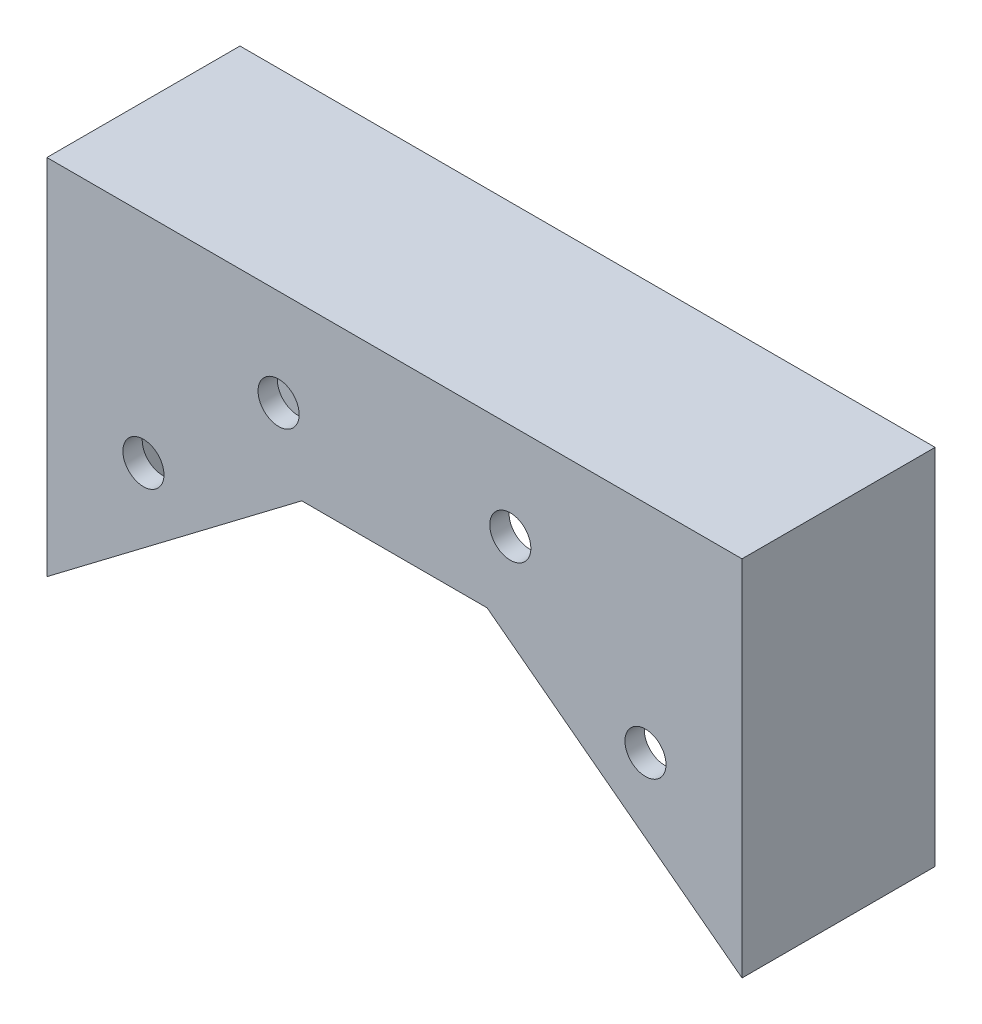
ISO-10303-21;
HEADER;
FILE_DESCRIPTION(('STEP AP214'),'2;1');
FILE_NAME('part.step','',(''),(''),'','','');
FILE_SCHEMA(('AUTOMOTIVE_DESIGN { 1 0 10303 214 1 1 1 1 }'));
ENDSEC;
DATA;
#1=APPLICATION_CONTEXT('core data for automotive mechanical design processes');
#2=APPLICATION_PROTOCOL_DEFINITION('international standard','automotive_design',2000,#1);
#3=PRODUCT_CONTEXT('',#1,'mechanical');
#4=PRODUCT('Part','Part','',(#3));
#5=PRODUCT_RELATED_PRODUCT_CATEGORY('part','',(#4));
#6=PRODUCT_DEFINITION_FORMATION('','',#4);
#7=PRODUCT_DEFINITION_CONTEXT('part definition',#1,'design');
#8=PRODUCT_DEFINITION('design','',#6,#7);
#9=PRODUCT_DEFINITION_SHAPE('','',#8);
#10=(LENGTH_UNIT() NAMED_UNIT(*) SI_UNIT(.MILLI.,.METRE.));
#11=(NAMED_UNIT(*) PLANE_ANGLE_UNIT() SI_UNIT($,.RADIAN.));
#12=(NAMED_UNIT(*) SI_UNIT($,.STERADIAN.) SOLID_ANGLE_UNIT());
#13=UNCERTAINTY_MEASURE_WITH_UNIT(LENGTH_MEASURE(1.E-05),#10,'distance_accuracy_value','');
#14=(GEOMETRIC_REPRESENTATION_CONTEXT(3) GLOBAL_UNCERTAINTY_ASSIGNED_CONTEXT((#13)) GLOBAL_UNIT_ASSIGNED_CONTEXT((#10,
#11,#12)) REPRESENTATION_CONTEXT('',''));
#15=CARTESIAN_POINT('',(0.,0.,0.));
#16=DIRECTION('',(0.,0.,1.));
#17=DIRECTION('',(1.,0.,0.));
#18=AXIS2_PLACEMENT_3D('',#15,#16,#17);
#19=CARTESIAN_POINT('',(-15.24,0.,15.875));
#20=DIRECTION('',(-0.603857687995462,0.79709214815401,0.));
#21=DIRECTION('',(-0.79709214815401,-0.603857687995462,0.));
#22=AXIS2_PLACEMENT_3D('',#19,#20,#21);
#23=PLANE('',#22);
#24=DIRECTION('',(0.79709214815401,0.603857687995462,0.));
#25=VECTOR('',#24,1.);
#26=CARTESIAN_POINT('',(-15.24,0.,-12.7));
#27=LINE('',#26,#25);
#28=CARTESIAN_POINT('',(-53.975,-29.344696969697,-12.7));
#29=VERTEX_POINT('',#28);
#30=CARTESIAN_POINT('',(-15.24,0.,-12.7));
#31=VERTEX_POINT('',#30);
#32=EDGE_CURVE('E176',#29,#31,#27,.T.);
#33=ORIENTED_EDGE('',*,*,#32,.F.);
#34=DIRECTION('',(0.,0.,-1.));
#35=VECTOR('',#34,1.);
#36=CARTESIAN_POINT('',(-53.975,-29.344696969697,15.875));
#37=LINE('',#36,#35);
#38=CARTESIAN_POINT('',(-53.975,-29.344696969697,12.7));
#39=VERTEX_POINT('',#38);
#40=EDGE_CURVE('E194',#39,#29,#37,.T.);
#41=ORIENTED_EDGE('',*,*,#40,.F.);
#42=DIRECTION('',(0.79709214815401,0.603857687995462,0.));
#43=VECTOR('',#42,1.);
#44=CARTESIAN_POINT('',(-15.24,0.,12.7));
#45=LINE('',#44,#43);
#46=CARTESIAN_POINT('',(-15.24,0.,12.7));
#47=VERTEX_POINT('',#46);
#48=EDGE_CURVE('E200',#39,#47,#45,.T.);
#49=ORIENTED_EDGE('',*,*,#48,.T.);
#50=DIRECTION('',(0.,0.,-1.));
#51=VECTOR('',#50,1.);
#52=CARTESIAN_POINT('',(-15.24,0.,15.875));
#53=LINE('',#52,#51);
#54=CARTESIAN_POINT('',(-15.24,0.,15.875));
#55=VERTEX_POINT('',#54);
#56=EDGE_CURVE('E11',#55,#47,#53,.T.);
#57=ORIENTED_EDGE('',*,*,#56,.F.);
#58=DIRECTION('',(0.79709214815401,0.603857687995462,0.));
#59=VECTOR('',#58,1.);
#60=CARTESIAN_POINT('',(-15.24,0.,15.875));
#61=LINE('',#60,#59);
#62=CARTESIAN_POINT('',(-57.15,-31.75,15.875));
#63=VERTEX_POINT('',#62);
#64=EDGE_CURVE('E143',#63,#55,#61,.T.);
#65=ORIENTED_EDGE('',*,*,#64,.F.);
#66=DIRECTION('',(0.,0.,-1.));
#67=VECTOR('',#66,1.);
#68=CARTESIAN_POINT('',(-57.15,-31.75,15.875));
#69=LINE('',#68,#67);
#70=CARTESIAN_POINT('',(-57.15,-31.75,-15.875));
#71=VERTEX_POINT('',#70);
#72=EDGE_CURVE('E126',#63,#71,#69,.T.);
#73=ORIENTED_EDGE('',*,*,#72,.T.);
#74=DIRECTION('',(0.79709214815401,0.603857687995462,0.));
#75=VECTOR('',#74,1.);
#76=CARTESIAN_POINT('',(-15.24,0.,-15.875));
#77=LINE('',#76,#75);
#78=CARTESIAN_POINT('',(-15.24,0.,-15.875));
#79=VERTEX_POINT('',#78);
#80=EDGE_CURVE('E130',#71,#79,#77,.T.);
#81=ORIENTED_EDGE('',*,*,#80,.T.);
#82=EDGE_CURVE('E40',#31,#79,#53,.T.);
#83=ORIENTED_EDGE('',*,*,#82,.F.);
#84=EDGE_LOOP('',(#33,#41,#49,#57,#65,#73,#81,#83));
#85=FACE_BOUND('',#84,.T.);
#86=ADVANCED_FACE('F32',(#85),#23,.F.);
#87=CARTESIAN_POINT('',(-15.24,0.,15.875));
#88=DIRECTION('',(0.,1.,0.));
#89=DIRECTION('',(0.,0.,1.));
#90=AXIS2_PLACEMENT_3D('',#87,#88,#89);
#91=PLANE('',#90);
#92=DIRECTION('',(1.,0.,0.));
#93=VECTOR('',#92,1.);
#94=CARTESIAN_POINT('',(-15.24,0.,-12.7));
#95=LINE('',#94,#93);
#96=CARTESIAN_POINT('',(15.24,0.,-12.7));
#97=VERTEX_POINT('',#96);
#98=EDGE_CURVE('E216',#31,#97,#95,.T.);
#99=ORIENTED_EDGE('',*,*,#98,.F.);
#100=ORIENTED_EDGE('',*,*,#82,.T.);
#101=DIRECTION('',(1.,0.,0.));
#102=VECTOR('',#101,1.);
#103=CARTESIAN_POINT('',(-15.24,0.,-15.875));
#104=LINE('',#103,#102);
#105=CARTESIAN_POINT('',(15.24,0.,-15.875));
#106=VERTEX_POINT('',#105);
#107=EDGE_CURVE('E133',#79,#106,#104,.T.);
#108=ORIENTED_EDGE('',*,*,#107,.T.);
#109=DIRECTION('',(0.,0.,-1.));
#110=VECTOR('',#109,1.);
#111=CARTESIAN_POINT('',(15.24,0.,15.875));
#112=LINE('',#111,#110);
#113=EDGE_CURVE('E147',#97,#106,#112,.T.);
#114=ORIENTED_EDGE('',*,*,#113,.F.);
#115=EDGE_LOOP('',(#99,#100,#108,#114));
#116=FACE_BOUND('',#115,.T.);
#117=ADVANCED_FACE('F274',(#116),#91,.F.);
#118=CARTESIAN_POINT('',(15.24,0.,15.875));
#119=DIRECTION('',(0.603857687995462,0.79709214815401,0.));
#120=DIRECTION('',(-0.79709214815401,0.603857687995462,0.));
#121=AXIS2_PLACEMENT_3D('',#118,#119,#120);
#122=PLANE('',#121);
#123=DIRECTION('',(0.79709214815401,-0.603857687995462,0.));
#124=VECTOR('',#123,1.);
#125=CARTESIAN_POINT('',(15.24,0.,-12.7));
#126=LINE('',#125,#124);
#127=CARTESIAN_POINT('',(53.975,-29.344696969697,-12.7));
#128=VERTEX_POINT('',#127);
#129=EDGE_CURVE('E181',#97,#128,#126,.T.);
#130=ORIENTED_EDGE('',*,*,#129,.F.);
#131=ORIENTED_EDGE('',*,*,#113,.T.);
#132=DIRECTION('',(0.79709214815401,-0.603857687995462,0.));
#133=VECTOR('',#132,1.);
#134=CARTESIAN_POINT('',(15.24,0.,-15.875));
#135=LINE('',#134,#133);
#136=CARTESIAN_POINT('',(57.15,-31.75,-15.875));
#137=VERTEX_POINT('',#136);
#138=EDGE_CURVE('E137',#106,#137,#135,.T.);
#139=ORIENTED_EDGE('',*,*,#138,.T.);
#140=DIRECTION('',(0.,0.,-1.));
#141=VECTOR('',#140,1.);
#142=CARTESIAN_POINT('',(57.15,-31.75,15.875));
#143=LINE('',#142,#141);
#144=CARTESIAN_POINT('',(57.15,-31.75,15.875));
#145=VERTEX_POINT('',#144);
#146=EDGE_CURVE('E121',#145,#137,#143,.T.);
#147=ORIENTED_EDGE('',*,*,#146,.F.);
#148=DIRECTION('',(0.79709214815401,-0.603857687995462,0.));
#149=VECTOR('',#148,1.);
#150=CARTESIAN_POINT('',(15.24,0.,15.875));
#151=LINE('',#150,#149);
#152=CARTESIAN_POINT('',(15.24,0.,15.875));
#153=VERTEX_POINT('',#152);
#154=EDGE_CURVE('E109',#153,#145,#151,.T.);
#155=ORIENTED_EDGE('',*,*,#154,.F.);
#156=CARTESIAN_POINT('',(15.24,0.,12.7));
#157=VERTEX_POINT('',#156);
#158=EDGE_CURVE('E148',#153,#157,#112,.T.);
#159=ORIENTED_EDGE('',*,*,#158,.T.);
#160=DIRECTION('',(0.79709214815401,-0.603857687995462,0.));
#161=VECTOR('',#160,1.);
#162=CARTESIAN_POINT('',(15.24,0.,12.7));
#163=LINE('',#162,#161);
#164=CARTESIAN_POINT('',(53.975,-29.344696969697,12.7));
#165=VERTEX_POINT('',#164);
#166=EDGE_CURVE('E188',#157,#165,#163,.T.);
#167=ORIENTED_EDGE('',*,*,#166,.T.);
#168=DIRECTION('',(0.,0.,-1.));
#169=VECTOR('',#168,1.);
#170=CARTESIAN_POINT('',(53.975,-29.344696969697,15.875));
#171=LINE('',#170,#169);
#172=EDGE_CURVE('E134',#165,#128,#171,.T.);
#173=ORIENTED_EDGE('',*,*,#172,.T.);
#174=EDGE_LOOP('',(#130,#131,#139,#147,#155,#159,#167,#173));
#175=FACE_BOUND('',#174,.T.);
#176=ADVANCED_FACE('F229',(#175),#122,.F.);
#177=ORIENTED_EDGE('',*,*,#56,.T.);
#178=DIRECTION('',(1.,0.,0.));
#179=VECTOR('',#178,1.);
#180=CARTESIAN_POINT('',(-15.24,0.,12.7));
#181=LINE('',#180,#179);
#182=EDGE_CURVE('E207',#47,#157,#181,.T.);
#183=ORIENTED_EDGE('',*,*,#182,.T.);
#184=ORIENTED_EDGE('',*,*,#158,.F.);
#185=DIRECTION('',(1.,0.,0.));
#186=VECTOR('',#185,1.);
#187=CARTESIAN_POINT('',(-15.24,0.,15.875));
#188=LINE('',#187,#186);
#189=EDGE_CURVE('E92',#55,#153,#188,.T.);
#190=ORIENTED_EDGE('',*,*,#189,.F.);
#191=EDGE_LOOP('',(#177,#183,#184,#190));
#192=FACE_BOUND('',#191,.T.);
#193=ADVANCED_FACE('F224',(#192),#91,.F.);
#194=CARTESIAN_POINT('',(57.15,-31.75,15.875));
#195=DIRECTION('',(-1.,0.,0.));
#196=DIRECTION('',(0.,-1.,0.));
#197=AXIS2_PLACEMENT_3D('',#194,#195,#196);
#198=PLANE('',#197);
#199=DIRECTION('',(0.,1.,0.));
#200=VECTOR('',#199,1.);
#201=CARTESIAN_POINT('',(57.15,-31.75,-15.875));
#202=LINE('',#201,#200);
#203=CARTESIAN_POINT('',(57.15,27.94,-15.875));
#204=VERTEX_POINT('',#203);
#205=EDGE_CURVE('E118',#137,#204,#202,.T.);
#206=ORIENTED_EDGE('',*,*,#205,.T.);
#207=DIRECTION('',(0.,0.,-1.));
#208=VECTOR('',#207,1.);
#209=CARTESIAN_POINT('',(57.15,27.94,15.875));
#210=LINE('',#209,#208);
#211=CARTESIAN_POINT('',(57.15,27.94,15.875));
#212=VERTEX_POINT('',#211);
#213=EDGE_CURVE('E115',#212,#204,#210,.T.);
#214=ORIENTED_EDGE('',*,*,#213,.F.);
#215=DIRECTION('',(0.,1.,0.));
#216=VECTOR('',#215,1.);
#217=CARTESIAN_POINT('',(57.15,-31.75,15.875));
#218=LINE('',#217,#216);
#219=EDGE_CURVE('E102',#145,#212,#218,.T.);
#220=ORIENTED_EDGE('',*,*,#219,.F.);
#221=ORIENTED_EDGE('',*,*,#146,.T.);
#222=EDGE_LOOP('',(#206,#214,#220,#221));
#223=FACE_BOUND('',#222,.T.);
#224=ADVANCED_FACE('F116',(#223),#198,.F.);
#225=CARTESIAN_POINT('',(57.15,27.94,15.875));
#226=DIRECTION('',(0.,-1.,0.));
#227=DIRECTION('',(0.,0.,-1.));
#228=AXIS2_PLACEMENT_3D('',#225,#226,#227);
#229=PLANE('',#228);
#230=DIRECTION('',(-1.,0.,0.));
#231=VECTOR('',#230,1.);
#232=CARTESIAN_POINT('',(57.15,27.94,-15.875));
#233=LINE('',#232,#231);
#234=CARTESIAN_POINT('',(-57.15,27.94,-15.875));
#235=VERTEX_POINT('',#234);
#236=EDGE_CURVE('E140',#204,#235,#233,.T.);
#237=ORIENTED_EDGE('',*,*,#236,.T.);
#238=DIRECTION('',(0.,0.,-1.));
#239=VECTOR('',#238,1.);
#240=CARTESIAN_POINT('',(-57.15,27.94,15.875));
#241=LINE('',#240,#239);
#242=CARTESIAN_POINT('',(-57.15,27.94,15.875));
#243=VERTEX_POINT('',#242);
#244=EDGE_CURVE('E122',#243,#235,#241,.T.);
#245=ORIENTED_EDGE('',*,*,#244,.F.);
#246=DIRECTION('',(-1.,0.,0.));
#247=VECTOR('',#246,1.);
#248=CARTESIAN_POINT('',(57.15,27.94,15.875));
#249=LINE('',#248,#247);
#250=EDGE_CURVE('E106',#212,#243,#249,.T.);
#251=ORIENTED_EDGE('',*,*,#250,.F.);
#252=ORIENTED_EDGE('',*,*,#213,.T.);
#253=EDGE_LOOP('',(#237,#245,#251,#252));
#254=FACE_BOUND('',#253,.T.);
#255=ADVANCED_FACE('F124',(#254),#229,.F.);
#256=CARTESIAN_POINT('',(-57.15,-31.75,15.875));
#257=DIRECTION('',(1.,0.,0.));
#258=DIRECTION('',(0.,1.,0.));
#259=AXIS2_PLACEMENT_3D('',#256,#257,#258);
#260=PLANE('',#259);
#261=DIRECTION('',(0.,-1.,0.));
#262=VECTOR('',#261,1.);
#263=CARTESIAN_POINT('',(-57.15,-31.75,-15.875));
#264=LINE('',#263,#262);
#265=EDGE_CURVE('E84',#235,#71,#264,.T.);
#266=ORIENTED_EDGE('',*,*,#265,.T.);
#267=ORIENTED_EDGE('',*,*,#72,.F.);
#268=DIRECTION('',(0.,-1.,0.));
#269=VECTOR('',#268,1.);
#270=CARTESIAN_POINT('',(-57.15,-31.75,15.875));
#271=LINE('',#270,#269);
#272=EDGE_CURVE('E57',#243,#63,#271,.T.);
#273=ORIENTED_EDGE('',*,*,#272,.F.);
#274=ORIENTED_EDGE('',*,*,#244,.T.);
#275=EDGE_LOOP('',(#266,#267,#273,#274));
#276=FACE_BOUND('',#275,.T.);
#277=ADVANCED_FACE('F235',(#276),#260,.F.);
#278=CARTESIAN_POINT('',(0.,0.,15.875));
#279=DIRECTION('',(0.,0.,1.));
#280=DIRECTION('',(1.,0.,0.));
#281=AXIS2_PLACEMENT_3D('',#278,#279,#280);
#282=PLANE('',#281);
#283=CARTESIAN_POINT('',(-41.275,-7.62,15.875));
#284=DIRECTION('',(0.,0.,-1.));
#285=DIRECTION('',(-1.,0.,0.));
#286=AXIS2_PLACEMENT_3D('',#283,#284,#285);
#287=CIRCLE('',#286,3.3782);
#288=CARTESIAN_POINT('',(-44.6532,-7.62,15.875));
#289=VERTEX_POINT('',#288);
#290=EDGE_CURVE('E155',#289,#289,#287,.T.);
#291=ORIENTED_EDGE('',*,*,#290,.T.);
#292=EDGE_LOOP('',(#291));
#293=FACE_BOUND('',#292,.T.);
#294=CARTESIAN_POINT('',(-19.05,12.065,15.875));
#295=DIRECTION('',(0.,0.,-1.));
#296=DIRECTION('',(-1.,0.,0.));
#297=AXIS2_PLACEMENT_3D('',#294,#295,#296);
#298=CIRCLE('',#297,3.3782);
#299=CARTESIAN_POINT('',(-22.4282,12.065,15.875));
#300=VERTEX_POINT('',#299);
#301=EDGE_CURVE('E424',#300,#300,#298,.T.);
#302=ORIENTED_EDGE('',*,*,#301,.T.);
#303=EDGE_LOOP('',(#302));
#304=FACE_BOUND('',#303,.T.);
#305=CARTESIAN_POINT('',(19.05,12.065,15.875));
#306=DIRECTION('',(0.,0.,-1.));
#307=DIRECTION('',(1.,0.,0.));
#308=AXIS2_PLACEMENT_3D('',#305,#306,#307);
#309=CIRCLE('',#308,3.3782);
#310=CARTESIAN_POINT('',(22.4282,12.065,15.875));
#311=VERTEX_POINT('',#310);
#312=EDGE_CURVE('E432',#311,#311,#309,.T.);
#313=ORIENTED_EDGE('',*,*,#312,.T.);
#314=EDGE_LOOP('',(#313));
#315=FACE_BOUND('',#314,.T.);
#316=CARTESIAN_POINT('',(41.275,-7.62,15.875));
#317=DIRECTION('',(0.,0.,-1.));
#318=DIRECTION('',(1.,0.,0.));
#319=AXIS2_PLACEMENT_3D('',#316,#317,#318);
#320=CIRCLE('',#319,3.3782);
#321=CARTESIAN_POINT('',(44.6532,-7.62,15.875));
#322=VERTEX_POINT('',#321);
#323=EDGE_CURVE('E438',#322,#322,#320,.T.);
#324=ORIENTED_EDGE('',*,*,#323,.T.);
#325=EDGE_LOOP('',(#324));
#326=FACE_BOUND('',#325,.T.);
#327=ORIENTED_EDGE('',*,*,#64,.T.);
#328=ORIENTED_EDGE('',*,*,#189,.T.);
#329=ORIENTED_EDGE('',*,*,#154,.T.);
#330=ORIENTED_EDGE('',*,*,#219,.T.);
#331=ORIENTED_EDGE('',*,*,#250,.T.);
#332=ORIENTED_EDGE('',*,*,#272,.T.);
#333=EDGE_LOOP('',(#327,#328,#329,#330,#331,#332));
#334=FACE_BOUND('',#333,.T.);
#335=ADVANCED_FACE('F104',(#293,#304,#315,#326,#334),#282,.T.);
#336=CARTESIAN_POINT('',(0.,0.,-15.875));
#337=DIRECTION('',(0.,0.,1.));
#338=DIRECTION('',(1.,0.,0.));
#339=AXIS2_PLACEMENT_3D('',#336,#337,#338);
#340=PLANE('',#339);
#341=CARTESIAN_POINT('',(-41.275,-7.62,-15.875));
#342=DIRECTION('',(0.,0.,-1.));
#343=DIRECTION('',(-1.,0.,0.));
#344=AXIS2_PLACEMENT_3D('',#341,#342,#343);
#345=CIRCLE('',#344,3.3782);
#346=CARTESIAN_POINT('',(-44.6532,-7.62,-15.875));
#347=VERTEX_POINT('',#346);
#348=EDGE_CURVE('E421',#347,#347,#345,.T.);
#349=ORIENTED_EDGE('',*,*,#348,.F.);
#350=EDGE_LOOP('',(#349));
#351=FACE_BOUND('',#350,.T.);
#352=CARTESIAN_POINT('',(-19.05,12.065,-15.875));
#353=DIRECTION('',(0.,0.,-1.));
#354=DIRECTION('',(-1.,0.,0.));
#355=AXIS2_PLACEMENT_3D('',#352,#353,#354);
#356=CIRCLE('',#355,3.3782);
#357=CARTESIAN_POINT('',(-22.4282,12.065,-15.875));
#358=VERTEX_POINT('',#357);
#359=EDGE_CURVE('E429',#358,#358,#356,.T.);
#360=ORIENTED_EDGE('',*,*,#359,.F.);
#361=EDGE_LOOP('',(#360));
#362=FACE_BOUND('',#361,.T.);
#363=CARTESIAN_POINT('',(19.05,12.065,-15.875));
#364=DIRECTION('',(0.,0.,-1.));
#365=DIRECTION('',(1.,0.,0.));
#366=AXIS2_PLACEMENT_3D('',#363,#364,#365);
#367=CIRCLE('',#366,3.3782);
#368=CARTESIAN_POINT('',(22.4282,12.065,-15.875));
#369=VERTEX_POINT('',#368);
#370=EDGE_CURVE('E435',#369,#369,#367,.T.);
#371=ORIENTED_EDGE('',*,*,#370,.F.);
#372=EDGE_LOOP('',(#371));
#373=FACE_BOUND('',#372,.T.);
#374=CARTESIAN_POINT('',(41.275,-7.62,-15.875));
#375=DIRECTION('',(0.,0.,-1.));
#376=DIRECTION('',(1.,0.,0.));
#377=AXIS2_PLACEMENT_3D('',#374,#375,#376);
#378=CIRCLE('',#377,3.3782);
#379=CARTESIAN_POINT('',(44.6532,-7.62,-15.875));
#380=VERTEX_POINT('',#379);
#381=EDGE_CURVE('E440',#380,#380,#378,.T.);
#382=ORIENTED_EDGE('',*,*,#381,.F.);
#383=EDGE_LOOP('',(#382));
#384=FACE_BOUND('',#383,.T.);
#385=ORIENTED_EDGE('',*,*,#80,.F.);
#386=ORIENTED_EDGE('',*,*,#265,.F.);
#387=ORIENTED_EDGE('',*,*,#236,.F.);
#388=ORIENTED_EDGE('',*,*,#205,.F.);
#389=ORIENTED_EDGE('',*,*,#138,.F.);
#390=ORIENTED_EDGE('',*,*,#107,.F.);
#391=EDGE_LOOP('',(#385,#386,#387,#388,#389,#390));
#392=FACE_BOUND('',#391,.T.);
#393=ADVANCED_FACE('F233',(#351,#362,#373,#384,#392),#340,.F.);
#394=CARTESIAN_POINT('',(53.975,-31.75,15.875));
#395=DIRECTION('',(-1.,0.,0.));
#396=DIRECTION('',(0.,-1.,0.));
#397=AXIS2_PLACEMENT_3D('',#394,#395,#396);
#398=PLANE('',#397);
#399=DIRECTION('',(0.,1.,0.));
#400=VECTOR('',#399,1.);
#401=CARTESIAN_POINT('',(53.975,-31.75,-12.7));
#402=LINE('',#401,#400);
#403=CARTESIAN_POINT('',(53.975,24.765,-12.7));
#404=VERTEX_POINT('',#403);
#405=EDGE_CURVE('E177',#128,#404,#402,.T.);
#406=ORIENTED_EDGE('',*,*,#405,.F.);
#407=ORIENTED_EDGE('',*,*,#172,.F.);
#408=DIRECTION('',(0.,1.,0.));
#409=VECTOR('',#408,1.);
#410=CARTESIAN_POINT('',(53.975,-31.75,12.7));
#411=LINE('',#410,#409);
#412=CARTESIAN_POINT('',(53.975,24.765,12.7));
#413=VERTEX_POINT('',#412);
#414=EDGE_CURVE('E48',#165,#413,#411,.T.);
#415=ORIENTED_EDGE('',*,*,#414,.T.);
#416=DIRECTION('',(0.,0.,-1.));
#417=VECTOR('',#416,1.);
#418=CARTESIAN_POINT('',(53.975,24.765,15.875));
#419=LINE('',#418,#417);
#420=EDGE_CURVE('E182',#413,#404,#419,.T.);
#421=ORIENTED_EDGE('',*,*,#420,.T.);
#422=EDGE_LOOP('',(#406,#407,#415,#421));
#423=FACE_BOUND('',#422,.T.);
#424=ADVANCED_FACE('F276',(#423),#398,.T.);
#425=CARTESIAN_POINT('',(57.15,24.765,15.875));
#426=DIRECTION('',(0.,-1.,0.));
#427=DIRECTION('',(0.,0.,-1.));
#428=AXIS2_PLACEMENT_3D('',#425,#426,#427);
#429=PLANE('',#428);
#430=DIRECTION('',(-1.,0.,0.));
#431=VECTOR('',#430,1.);
#432=CARTESIAN_POINT('',(57.15,24.765,-12.7));
#433=LINE('',#432,#431);
#434=CARTESIAN_POINT('',(-53.975,24.765,-12.7));
#435=VERTEX_POINT('',#434);
#436=EDGE_CURVE('E180',#404,#435,#433,.T.);
#437=ORIENTED_EDGE('',*,*,#436,.F.);
#438=ORIENTED_EDGE('',*,*,#420,.F.);
#439=DIRECTION('',(-1.,0.,0.));
#440=VECTOR('',#439,1.);
#441=CARTESIAN_POINT('',(57.15,24.765,12.7));
#442=LINE('',#441,#440);
#443=CARTESIAN_POINT('',(-53.975,24.765,12.7));
#444=VERTEX_POINT('',#443);
#445=EDGE_CURVE('E187',#413,#444,#442,.T.);
#446=ORIENTED_EDGE('',*,*,#445,.T.);
#447=DIRECTION('',(0.,0.,-1.));
#448=VECTOR('',#447,1.);
#449=CARTESIAN_POINT('',(-53.975,24.765,15.875));
#450=LINE('',#449,#448);
#451=EDGE_CURVE('E185',#444,#435,#450,.T.);
#452=ORIENTED_EDGE('',*,*,#451,.T.);
#453=EDGE_LOOP('',(#437,#438,#446,#452));
#454=FACE_BOUND('',#453,.T.);
#455=ADVANCED_FACE('F264',(#454),#429,.T.);
#456=CARTESIAN_POINT('',(-53.975,-31.75,15.875));
#457=DIRECTION('',(1.,0.,0.));
#458=DIRECTION('',(0.,1.,0.));
#459=AXIS2_PLACEMENT_3D('',#456,#457,#458);
#460=PLANE('',#459);
#461=DIRECTION('',(0.,-1.,0.));
#462=VECTOR('',#461,1.);
#463=CARTESIAN_POINT('',(-53.975,-31.75,-12.7));
#464=LINE('',#463,#462);
#465=EDGE_CURVE('E191',#435,#29,#464,.T.);
#466=ORIENTED_EDGE('',*,*,#465,.F.);
#467=ORIENTED_EDGE('',*,*,#451,.F.);
#468=DIRECTION('',(0.,-1.,0.));
#469=VECTOR('',#468,1.);
#470=CARTESIAN_POINT('',(-53.975,-31.75,12.7));
#471=LINE('',#470,#469);
#472=EDGE_CURVE('E197',#444,#39,#471,.T.);
#473=ORIENTED_EDGE('',*,*,#472,.T.);
#474=ORIENTED_EDGE('',*,*,#40,.T.);
#475=EDGE_LOOP('',(#466,#467,#473,#474));
#476=FACE_BOUND('',#475,.T.);
#477=ADVANCED_FACE('F268',(#476),#460,.T.);
#478=CARTESIAN_POINT('',(0.,0.,12.7));
#479=DIRECTION('',(0.,0.,1.));
#480=DIRECTION('',(1.,0.,0.));
#481=AXIS2_PLACEMENT_3D('',#478,#479,#480);
#482=PLANE('',#481);
#483=CARTESIAN_POINT('',(-41.275,-7.62,12.7));
#484=DIRECTION('',(0.,0.,1.));
#485=DIRECTION('',(1.,0.,0.));
#486=AXIS2_PLACEMENT_3D('',#483,#484,#485);
#487=CIRCLE('',#486,3.3782);
#488=CARTESIAN_POINT('',(-37.8968,-7.62,12.7));
#489=VERTEX_POINT('',#488);
#490=EDGE_CURVE('E173',#489,#489,#487,.T.);
#491=ORIENTED_EDGE('',*,*,#490,.T.);
#492=EDGE_LOOP('',(#491));
#493=FACE_BOUND('',#492,.T.);
#494=CARTESIAN_POINT('',(-19.05,12.065,12.7));
#495=DIRECTION('',(0.,0.,1.));
#496=DIRECTION('',(1.,0.,0.));
#497=AXIS2_PLACEMENT_3D('',#494,#495,#496);
#498=CIRCLE('',#497,3.3782);
#499=CARTESIAN_POINT('',(-15.6718,12.065,12.7));
#500=VERTEX_POINT('',#499);
#501=EDGE_CURVE('E161',#500,#500,#498,.T.);
#502=ORIENTED_EDGE('',*,*,#501,.T.);
#503=EDGE_LOOP('',(#502));
#504=FACE_BOUND('',#503,.T.);
#505=CARTESIAN_POINT('',(19.05,12.065,12.7));
#506=DIRECTION('',(0.,0.,1.));
#507=DIRECTION('',(1.,0.,0.));
#508=AXIS2_PLACEMENT_3D('',#505,#506,#507);
#509=CIRCLE('',#508,3.3782);
#510=CARTESIAN_POINT('',(22.4282,12.065,12.7));
#511=VERTEX_POINT('',#510);
#512=EDGE_CURVE('E158',#511,#511,#509,.T.);
#513=ORIENTED_EDGE('',*,*,#512,.T.);
#514=EDGE_LOOP('',(#513));
#515=FACE_BOUND('',#514,.T.);
#516=CARTESIAN_POINT('',(41.275,-7.62,12.7));
#517=DIRECTION('',(0.,0.,1.));
#518=DIRECTION('',(1.,0.,0.));
#519=AXIS2_PLACEMENT_3D('',#516,#517,#518);
#520=CIRCLE('',#519,3.3782);
#521=CARTESIAN_POINT('',(44.6532,-7.62,12.7));
#522=VERTEX_POINT('',#521);
#523=EDGE_CURVE('E154',#522,#522,#520,.T.);
#524=ORIENTED_EDGE('',*,*,#523,.T.);
#525=EDGE_LOOP('',(#524));
#526=FACE_BOUND('',#525,.T.);
#527=ORIENTED_EDGE('',*,*,#48,.F.);
#528=ORIENTED_EDGE('',*,*,#472,.F.);
#529=ORIENTED_EDGE('',*,*,#445,.F.);
#530=ORIENTED_EDGE('',*,*,#414,.F.);
#531=ORIENTED_EDGE('',*,*,#166,.F.);
#532=ORIENTED_EDGE('',*,*,#182,.F.);
#533=EDGE_LOOP('',(#527,#528,#529,#530,#531,#532));
#534=FACE_BOUND('',#533,.T.);
#535=ADVANCED_FACE('F269',(#493,#504,#515,#526,#534),#482,.F.);
#536=CARTESIAN_POINT('',(0.,0.,-12.7));
#537=DIRECTION('',(0.,0.,1.));
#538=DIRECTION('',(1.,0.,0.));
#539=AXIS2_PLACEMENT_3D('',#536,#537,#538);
#540=PLANE('',#539);
#541=CARTESIAN_POINT('',(-41.275,-7.62,-12.7));
#542=DIRECTION('',(0.,0.,1.));
#543=DIRECTION('',(1.,0.,0.));
#544=AXIS2_PLACEMENT_3D('',#541,#542,#543);
#545=CIRCLE('',#544,3.3782);
#546=CARTESIAN_POINT('',(-37.8968,-7.62,-12.7));
#547=VERTEX_POINT('',#546);
#548=EDGE_CURVE('E35',#547,#547,#545,.T.);
#549=ORIENTED_EDGE('',*,*,#548,.F.);
#550=EDGE_LOOP('',(#549));
#551=FACE_BOUND('',#550,.T.);
#552=CARTESIAN_POINT('',(-19.05,12.065,-12.7));
#553=DIRECTION('',(0.,0.,1.));
#554=DIRECTION('',(1.,0.,0.));
#555=AXIS2_PLACEMENT_3D('',#552,#553,#554);
#556=CIRCLE('',#555,3.3782);
#557=CARTESIAN_POINT('',(-15.6718,12.065,-12.7));
#558=VERTEX_POINT('',#557);
#559=EDGE_CURVE('E159',#558,#558,#556,.T.);
#560=ORIENTED_EDGE('',*,*,#559,.F.);
#561=EDGE_LOOP('',(#560));
#562=FACE_BOUND('',#561,.T.);
#563=CARTESIAN_POINT('',(19.05,12.065,-12.7));
#564=DIRECTION('',(0.,0.,1.));
#565=DIRECTION('',(1.,0.,0.));
#566=AXIS2_PLACEMENT_3D('',#563,#564,#565);
#567=CIRCLE('',#566,3.3782);
#568=CARTESIAN_POINT('',(22.4282,12.065,-12.7));
#569=VERTEX_POINT('',#568);
#570=EDGE_CURVE('E156',#569,#569,#567,.T.);
#571=ORIENTED_EDGE('',*,*,#570,.F.);
#572=EDGE_LOOP('',(#571));
#573=FACE_BOUND('',#572,.T.);
#574=CARTESIAN_POINT('',(41.275,-7.62,-12.7));
#575=DIRECTION('',(0.,0.,1.));
#576=DIRECTION('',(1.,0.,0.));
#577=AXIS2_PLACEMENT_3D('',#574,#575,#576);
#578=CIRCLE('',#577,3.3782);
#579=CARTESIAN_POINT('',(44.6532,-7.62,-12.7));
#580=VERTEX_POINT('',#579);
#581=EDGE_CURVE('E151',#580,#580,#578,.T.);
#582=ORIENTED_EDGE('',*,*,#581,.F.);
#583=EDGE_LOOP('',(#582));
#584=FACE_BOUND('',#583,.T.);
#585=ORIENTED_EDGE('',*,*,#32,.T.);
#586=ORIENTED_EDGE('',*,*,#98,.T.);
#587=ORIENTED_EDGE('',*,*,#129,.T.);
#588=ORIENTED_EDGE('',*,*,#405,.T.);
#589=ORIENTED_EDGE('',*,*,#436,.T.);
#590=ORIENTED_EDGE('',*,*,#465,.T.);
#591=EDGE_LOOP('',(#585,#586,#587,#588,#589,#590));
#592=FACE_BOUND('',#591,.T.);
#593=ADVANCED_FACE('F271',(#551,#562,#573,#584,#592),#540,.T.);
#594=CARTESIAN_POINT('',(41.275,-7.62,15.875));
#595=DIRECTION('',(0.,0.,-1.));
#596=DIRECTION('',(-1.,0.,0.));
#597=AXIS2_PLACEMENT_3D('',#594,#595,#596);
#598=CYLINDRICAL_SURFACE('',#597,3.3782);
#599=ORIENTED_EDGE('',*,*,#581,.T.);
#600=EDGE_LOOP('',(#599));
#601=FACE_BOUND('',#600,.T.);
#602=ORIENTED_EDGE('',*,*,#381,.T.);
#603=EDGE_LOOP('',(#602));
#604=FACE_BOUND('',#603,.T.);
#605=ADVANCED_FACE('F313',(#601,#604),#598,.F.);
#606=CARTESIAN_POINT('',(19.05,12.065,15.875));
#607=DIRECTION('',(0.,0.,-1.));
#608=DIRECTION('',(-1.,0.,0.));
#609=AXIS2_PLACEMENT_3D('',#606,#607,#608);
#610=CYLINDRICAL_SURFACE('',#609,3.3782);
#611=ORIENTED_EDGE('',*,*,#570,.T.);
#612=EDGE_LOOP('',(#611));
#613=FACE_BOUND('',#612,.T.);
#614=ORIENTED_EDGE('',*,*,#370,.T.);
#615=EDGE_LOOP('',(#614));
#616=FACE_BOUND('',#615,.T.);
#617=ADVANCED_FACE('F342',(#613,#616),#610,.F.);
#618=CARTESIAN_POINT('',(-19.05,12.065,15.875));
#619=DIRECTION('',(0.,0.,-1.));
#620=DIRECTION('',(-1.,0.,0.));
#621=AXIS2_PLACEMENT_3D('',#618,#619,#620);
#622=CYLINDRICAL_SURFACE('',#621,3.3782);
#623=ORIENTED_EDGE('',*,*,#559,.T.);
#624=EDGE_LOOP('',(#623));
#625=FACE_BOUND('',#624,.T.);
#626=ORIENTED_EDGE('',*,*,#359,.T.);
#627=EDGE_LOOP('',(#626));
#628=FACE_BOUND('',#627,.T.);
#629=ADVANCED_FACE('F349',(#625,#628),#622,.F.);
#630=CARTESIAN_POINT('',(-41.275,-7.62,15.875));
#631=DIRECTION('',(0.,0.,-1.));
#632=DIRECTION('',(-1.,0.,0.));
#633=AXIS2_PLACEMENT_3D('',#630,#631,#632);
#634=CYLINDRICAL_SURFACE('',#633,3.3782);
#635=ORIENTED_EDGE('',*,*,#548,.T.);
#636=EDGE_LOOP('',(#635));
#637=FACE_BOUND('',#636,.T.);
#638=ORIENTED_EDGE('',*,*,#348,.T.);
#639=EDGE_LOOP('',(#638));
#640=FACE_BOUND('',#639,.T.);
#641=ADVANCED_FACE('F358',(#637,#640),#634,.F.);
#642=ORIENTED_EDGE('',*,*,#323,.F.);
#643=EDGE_LOOP('',(#642));
#644=FACE_BOUND('',#643,.T.);
#645=ORIENTED_EDGE('',*,*,#523,.F.);
#646=EDGE_LOOP('',(#645));
#647=FACE_BOUND('',#646,.T.);
#648=ADVANCED_FACE('F344',(#644,#647),#598,.F.);
#649=ORIENTED_EDGE('',*,*,#312,.F.);
#650=EDGE_LOOP('',(#649));
#651=FACE_BOUND('',#650,.T.);
#652=ORIENTED_EDGE('',*,*,#512,.F.);
#653=EDGE_LOOP('',(#652));
#654=FACE_BOUND('',#653,.T.);
#655=ADVANCED_FACE('F352',(#651,#654),#610,.F.);
#656=ORIENTED_EDGE('',*,*,#301,.F.);
#657=EDGE_LOOP('',(#656));
#658=FACE_BOUND('',#657,.T.);
#659=ORIENTED_EDGE('',*,*,#501,.F.);
#660=EDGE_LOOP('',(#659));
#661=FACE_BOUND('',#660,.T.);
#662=ADVANCED_FACE('F360',(#658,#661),#622,.F.);
#663=ORIENTED_EDGE('',*,*,#290,.F.);
#664=EDGE_LOOP('',(#663));
#665=FACE_BOUND('',#664,.T.);
#666=ORIENTED_EDGE('',*,*,#490,.F.);
#667=EDGE_LOOP('',(#666));
#668=FACE_BOUND('',#667,.T.);
#669=ADVANCED_FACE('F368',(#665,#668),#634,.F.);
#670=CLOSED_SHELL('',(#86,#117,#176,#193,#224,#255,#277,#335,#393,#424,#455,#477,#535,#593,#605,
#617,#629,#641,#648,#655,#662,#669));
#671=MANIFOLD_SOLID_BREP('B2',#670);
#672=ADVANCED_BREP_SHAPE_REPRESENTATION('',(#18,#671),#14);
#673=SHAPE_DEFINITION_REPRESENTATION(#9,#672);
ENDSEC;
END-ISO-10303-21;
